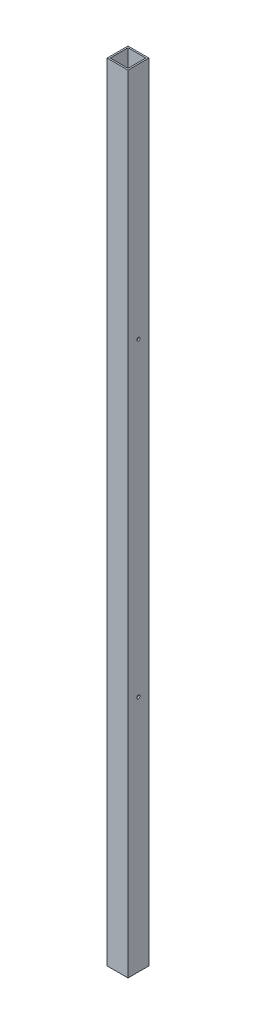
ISO-10303-21;
HEADER;
FILE_DESCRIPTION(('STEP AP214'),'2;1');
FILE_NAME('part.step','',(''),(''),'','','');
FILE_SCHEMA(('AUTOMOTIVE_DESIGN { 1 0 10303 214 1 1 1 1 }'));
ENDSEC;
DATA;
#1=APPLICATION_CONTEXT('core data for automotive mechanical design processes');
#2=APPLICATION_PROTOCOL_DEFINITION('international standard','automotive_design',2000,#1);
#3=PRODUCT_CONTEXT('',#1,'mechanical');
#4=PRODUCT('Part','Part','',(#3));
#5=PRODUCT_RELATED_PRODUCT_CATEGORY('part','',(#4));
#6=PRODUCT_DEFINITION_FORMATION('','',#4);
#7=PRODUCT_DEFINITION_CONTEXT('part definition',#1,'design');
#8=PRODUCT_DEFINITION('design','',#6,#7);
#9=PRODUCT_DEFINITION_SHAPE('','',#8);
#10=(LENGTH_UNIT() NAMED_UNIT(*) SI_UNIT(.MILLI.,.METRE.));
#11=(NAMED_UNIT(*) PLANE_ANGLE_UNIT() SI_UNIT($,.RADIAN.));
#12=(NAMED_UNIT(*) SI_UNIT($,.STERADIAN.) SOLID_ANGLE_UNIT());
#13=UNCERTAINTY_MEASURE_WITH_UNIT(LENGTH_MEASURE(1.E-05),#10,'distance_accuracy_value','');
#14=(GEOMETRIC_REPRESENTATION_CONTEXT(3) GLOBAL_UNCERTAINTY_ASSIGNED_CONTEXT((#13)) GLOBAL_UNIT_ASSIGNED_CONTEXT((#10,
#11,#12)) REPRESENTATION_CONTEXT('',''));
#15=CARTESIAN_POINT('',(0.,0.,0.));
#16=DIRECTION('',(0.,0.,1.));
#17=DIRECTION('',(1.,0.,0.));
#18=AXIS2_PLACEMENT_3D('',#15,#16,#17);
#19=CARTESIAN_POINT('',(1881.79309813872,-330.2,22.225));
#20=DIRECTION('',(1.,0.,0.));
#21=DIRECTION('',(0.,1.,0.));
#22=AXIS2_PLACEMENT_3D('',#19,#20,#21);
#23=CYLINDRICAL_SURFACE('',#22,3.3782);
#24=CARTESIAN_POINT('',(244.475,-330.2,22.225));
#25=DIRECTION('',(1.,0.,0.));
#26=DIRECTION('',(0.,1.,0.));
#27=AXIS2_PLACEMENT_3D('',#24,#25,#26);
#28=CIRCLE('',#27,3.3782);
#29=CARTESIAN_POINT('',(244.475,-326.8218,22.225));
#30=VERTEX_POINT('',#29);
#31=EDGE_CURVE('E19',#30,#30,#28,.F.);
#32=ORIENTED_EDGE('',*,*,#31,.T.);
#33=EDGE_LOOP('',(#32));
#34=FACE_BOUND('',#33,.T.);
#35=CARTESIAN_POINT('',(247.65,-330.2,22.225));
#36=DIRECTION('',(1.,0.,0.));
#37=DIRECTION('',(0.,1.,0.));
#38=AXIS2_PLACEMENT_3D('',#35,#36,#37);
#39=CIRCLE('',#38,3.3782);
#40=CARTESIAN_POINT('',(247.65,-326.8218,22.225));
#41=VERTEX_POINT('',#40);
#42=EDGE_CURVE('E132',#41,#41,#39,.F.);
#43=ORIENTED_EDGE('',*,*,#42,.F.);
#44=EDGE_LOOP('',(#43));
#45=FACE_BOUND('',#44,.T.);
#46=ADVANCED_FACE('F16',(#34,#45),#23,.F.);
#47=CARTESIAN_POINT('',(1881.79309813872,330.2,22.225));
#48=DIRECTION('',(1.,0.,0.));
#49=DIRECTION('',(0.,1.,0.));
#50=AXIS2_PLACEMENT_3D('',#47,#48,#49);
#51=CYLINDRICAL_SURFACE('',#50,3.3782);
#52=CARTESIAN_POINT('',(244.475,330.2,22.225));
#53=DIRECTION('',(1.,0.,0.));
#54=DIRECTION('',(0.,1.,0.));
#55=AXIS2_PLACEMENT_3D('',#52,#53,#54);
#56=CIRCLE('',#55,3.3782);
#57=CARTESIAN_POINT('',(244.475,333.5782,22.225));
#58=VERTEX_POINT('',#57);
#59=EDGE_CURVE('E142',#58,#58,#56,.F.);
#60=ORIENTED_EDGE('',*,*,#59,.T.);
#61=EDGE_LOOP('',(#60));
#62=FACE_BOUND('',#61,.T.);
#63=CARTESIAN_POINT('',(247.65,330.2,22.225));
#64=DIRECTION('',(1.,0.,0.));
#65=DIRECTION('',(0.,1.,0.));
#66=AXIS2_PLACEMENT_3D('',#63,#64,#65);
#67=CIRCLE('',#66,3.3782);
#68=CARTESIAN_POINT('',(247.65,333.5782,22.225));
#69=VERTEX_POINT('',#68);
#70=EDGE_CURVE('E130',#69,#69,#67,.F.);
#71=ORIENTED_EDGE('',*,*,#70,.F.);
#72=EDGE_LOOP('',(#71));
#73=FACE_BOUND('',#72,.T.);
#74=ADVANCED_FACE('F292',(#62,#73),#51,.F.);
#75=CARTESIAN_POINT('',(1881.79309813872,-330.2,22.225));
#76=DIRECTION('',(1.,0.,0.));
#77=DIRECTION('',(0.,1.,0.));
#78=AXIS2_PLACEMENT_3D('',#75,#76,#77);
#79=CYLINDRICAL_SURFACE('',#78,3.3782);
#80=CARTESIAN_POINT('',(203.2,-330.2,22.225));
#81=DIRECTION('',(1.,0.,0.));
#82=DIRECTION('',(0.,1.,0.));
#83=AXIS2_PLACEMENT_3D('',#80,#81,#82);
#84=CIRCLE('',#83,3.3782);
#85=CARTESIAN_POINT('',(203.2,-326.8218,22.225));
#86=VERTEX_POINT('',#85);
#87=EDGE_CURVE('E148',#86,#86,#84,.F.);
#88=ORIENTED_EDGE('',*,*,#87,.T.);
#89=EDGE_LOOP('',(#88));
#90=FACE_BOUND('',#89,.T.);
#91=CARTESIAN_POINT('',(206.375,-330.2,22.225));
#92=DIRECTION('',(1.,0.,0.));
#93=DIRECTION('',(0.,1.,0.));
#94=AXIS2_PLACEMENT_3D('',#91,#92,#93);
#95=CIRCLE('',#94,3.3782);
#96=CARTESIAN_POINT('',(206.375,-326.8218,22.225));
#97=VERTEX_POINT('',#96);
#98=EDGE_CURVE('E141',#97,#97,#95,.F.);
#99=ORIENTED_EDGE('',*,*,#98,.F.);
#100=EDGE_LOOP('',(#99));
#101=FACE_BOUND('',#100,.T.);
#102=ADVANCED_FACE('F283',(#90,#101),#79,.F.);
#103=CARTESIAN_POINT('',(1881.79309813872,330.2,22.225));
#104=DIRECTION('',(1.,0.,0.));
#105=DIRECTION('',(0.,1.,0.));
#106=AXIS2_PLACEMENT_3D('',#103,#104,#105);
#107=CYLINDRICAL_SURFACE('',#106,3.3782);
#108=CARTESIAN_POINT('',(203.2,330.2,22.225));
#109=DIRECTION('',(1.,0.,0.));
#110=DIRECTION('',(0.,1.,0.));
#111=AXIS2_PLACEMENT_3D('',#108,#109,#110);
#112=CIRCLE('',#111,3.3782);
#113=CARTESIAN_POINT('',(203.2,333.5782,22.225));
#114=VERTEX_POINT('',#113);
#115=EDGE_CURVE('E143',#114,#114,#112,.F.);
#116=ORIENTED_EDGE('',*,*,#115,.T.);
#117=EDGE_LOOP('',(#116));
#118=FACE_BOUND('',#117,.T.);
#119=CARTESIAN_POINT('',(206.375,330.2,22.225));
#120=DIRECTION('',(1.,0.,0.));
#121=DIRECTION('',(0.,1.,0.));
#122=AXIS2_PLACEMENT_3D('',#119,#120,#121);
#123=CIRCLE('',#122,3.3782);
#124=CARTESIAN_POINT('',(206.375,333.5782,22.225));
#125=VERTEX_POINT('',#124);
#126=EDGE_CURVE('E136',#125,#125,#123,.F.);
#127=ORIENTED_EDGE('',*,*,#126,.F.);
#128=EDGE_LOOP('',(#127));
#129=FACE_BOUND('',#128,.T.);
#130=ADVANCED_FACE('F187',(#118,#129),#107,.F.);
#131=CARTESIAN_POINT('',(-104.775,-2.55795384873636E-13,0.));
#132=DIRECTION('',(0.,0.,1.));
#133=DIRECTION('',(1.,0.,0.));
#134=AXIS2_PLACEMENT_3D('',#131,#132,#133);
#135=PLANE('',#134);
#136=DIRECTION('',(1.,0.,0.));
#137=VECTOR('',#136,1.);
#138=CARTESIAN_POINT('',(225.425,-838.2,0.));
#139=LINE('',#138,#137);
#140=CARTESIAN_POINT('',(203.2,-838.2,0.));
#141=VERTEX_POINT('',#140);
#142=CARTESIAN_POINT('',(247.65,-838.2,0.));
#143=VERTEX_POINT('',#142);
#144=EDGE_CURVE('E339',#141,#143,#139,.T.);
#145=ORIENTED_EDGE('',*,*,#144,.F.);
#146=DIRECTION('',(0.,1.,0.));
#147=VECTOR('',#146,1.);
#148=CARTESIAN_POINT('',(203.2,-2.55795384873636E-13,0.));
#149=LINE('',#148,#147);
#150=CARTESIAN_POINT('',(203.2,838.2,0.));
#151=VERTEX_POINT('',#150);
#152=EDGE_CURVE('E364',#141,#151,#149,.T.);
#153=ORIENTED_EDGE('',*,*,#152,.T.);
#154=DIRECTION('',(1.,0.,0.));
#155=VECTOR('',#154,1.);
#156=CARTESIAN_POINT('',(225.425,838.2,0.));
#157=LINE('',#156,#155);
#158=CARTESIAN_POINT('',(247.65,838.2,0.));
#159=VERTEX_POINT('',#158);
#160=EDGE_CURVE('E101',#151,#159,#157,.T.);
#161=ORIENTED_EDGE('',*,*,#160,.T.);
#162=DIRECTION('',(0.,1.,0.));
#163=VECTOR('',#162,1.);
#164=CARTESIAN_POINT('',(247.65,-2.55795384873636E-13,0.));
#165=LINE('',#164,#163);
#166=EDGE_CURVE('E126',#143,#159,#165,.T.);
#167=ORIENTED_EDGE('',*,*,#166,.F.);
#168=EDGE_LOOP('',(#145,#153,#161,#167));
#169=FACE_BOUND('',#168,.T.);
#170=ADVANCED_FACE('F177',(#169),#135,.F.);
#171=CARTESIAN_POINT('',(244.475,-2.56636462922595E-13,44.45));
#172=DIRECTION('',(1.,0.,0.));
#173=DIRECTION('',(0.,1.,0.));
#174=AXIS2_PLACEMENT_3D('',#171,#172,#173);
#175=PLANE('',#174);
#176=DIRECTION('',(0.,0.,-1.));
#177=VECTOR('',#176,1.);
#178=CARTESIAN_POINT('',(244.475,-838.2,44.45));
#179=LINE('',#178,#177);
#180=CARTESIAN_POINT('',(244.475,-838.2,41.275));
#181=VERTEX_POINT('',#180);
#182=CARTESIAN_POINT('',(244.475,-838.2,3.175));
#183=VERTEX_POINT('',#182);
#184=EDGE_CURVE('E356',#181,#183,#179,.T.);
#185=ORIENTED_EDGE('',*,*,#184,.F.);
#186=DIRECTION('',(0.,1.,0.));
#187=VECTOR('',#186,1.);
#188=CARTESIAN_POINT('',(244.475,-2.55795384873636E-13,41.275));
#189=LINE('',#188,#187);
#190=CARTESIAN_POINT('',(244.475,838.2,41.275));
#191=VERTEX_POINT('',#190);
#192=EDGE_CURVE('E112',#181,#191,#189,.T.);
#193=ORIENTED_EDGE('',*,*,#192,.T.);
#194=DIRECTION('',(0.,0.,-1.));
#195=VECTOR('',#194,1.);
#196=CARTESIAN_POINT('',(244.475,838.2,44.45));
#197=LINE('',#196,#195);
#198=CARTESIAN_POINT('',(244.475,838.2,3.175));
#199=VERTEX_POINT('',#198);
#200=EDGE_CURVE('E116',#191,#199,#197,.T.);
#201=ORIENTED_EDGE('',*,*,#200,.T.);
#202=DIRECTION('',(0.,1.,0.));
#203=VECTOR('',#202,1.);
#204=CARTESIAN_POINT('',(244.475,-2.55795384873636E-13,3.175));
#205=LINE('',#204,#203);
#206=EDGE_CURVE('E137',#183,#199,#205,.T.);
#207=ORIENTED_EDGE('',*,*,#206,.F.);
#208=EDGE_LOOP('',(#185,#193,#201,#207));
#209=FACE_BOUND('',#208,.T.);
#210=ORIENTED_EDGE('',*,*,#59,.F.);
#211=EDGE_LOOP('',(#210));
#212=FACE_BOUND('',#211,.T.);
#213=ORIENTED_EDGE('',*,*,#31,.F.);
#214=EDGE_LOOP('',(#213));
#215=FACE_BOUND('',#214,.T.);
#216=ADVANCED_FACE('F174',(#209,#212,#215),#175,.F.);
#217=CARTESIAN_POINT('',(-104.775,-2.55795384873636E-13,3.175));
#218=DIRECTION('',(0.,0.,1.));
#219=DIRECTION('',(1.,0.,0.));
#220=AXIS2_PLACEMENT_3D('',#217,#218,#219);
#221=PLANE('',#220);
#222=DIRECTION('',(0.,1.,0.));
#223=VECTOR('',#222,1.);
#224=CARTESIAN_POINT('',(206.375,-2.54954306824678E-13,3.175));
#225=LINE('',#224,#223);
#226=CARTESIAN_POINT('',(206.375,-838.2,3.175));
#227=VERTEX_POINT('',#226);
#228=CARTESIAN_POINT('',(206.375,838.2,3.175));
#229=VERTEX_POINT('',#228);
#230=EDGE_CURVE('E95',#227,#229,#225,.T.);
#231=ORIENTED_EDGE('',*,*,#230,.F.);
#232=DIRECTION('',(1.,0.,0.));
#233=VECTOR('',#232,1.);
#234=CARTESIAN_POINT('',(225.425,-838.2,3.175));
#235=LINE('',#234,#233);
#236=EDGE_CURVE('E352',#183,#227,#235,.F.);
#237=ORIENTED_EDGE('',*,*,#236,.F.);
#238=ORIENTED_EDGE('',*,*,#206,.T.);
#239=DIRECTION('',(1.,0.,0.));
#240=VECTOR('',#239,1.);
#241=CARTESIAN_POINT('',(225.425,838.2,3.175));
#242=LINE('',#241,#240);
#243=EDGE_CURVE('E118',#199,#229,#242,.F.);
#244=ORIENTED_EDGE('',*,*,#243,.T.);
#245=EDGE_LOOP('',(#231,#237,#238,#244));
#246=FACE_BOUND('',#245,.T.);
#247=ADVANCED_FACE('F176',(#246),#221,.T.);
#248=CARTESIAN_POINT('',(206.375,-2.54954306824678E-13,44.45));
#249=DIRECTION('',(1.,0.,0.));
#250=DIRECTION('',(0.,1.,0.));
#251=AXIS2_PLACEMENT_3D('',#248,#249,#250);
#252=PLANE('',#251);
#253=DIRECTION('',(0.,1.,0.));
#254=VECTOR('',#253,1.);
#255=CARTESIAN_POINT('',(206.375,-2.55795384873636E-13,41.275));
#256=LINE('',#255,#254);
#257=CARTESIAN_POINT('',(206.375,838.2,41.275));
#258=VERTEX_POINT('',#257);
#259=CARTESIAN_POINT('',(206.375,-838.2,41.275));
#260=VERTEX_POINT('',#259);
#261=EDGE_CURVE('E93',#258,#260,#256,.F.);
#262=ORIENTED_EDGE('',*,*,#261,.T.);
#263=DIRECTION('',(0.,0.,-1.));
#264=VECTOR('',#263,1.);
#265=CARTESIAN_POINT('',(206.375,-838.2,44.45));
#266=LINE('',#265,#264);
#267=EDGE_CURVE('E349',#227,#260,#266,.F.);
#268=ORIENTED_EDGE('',*,*,#267,.F.);
#269=ORIENTED_EDGE('',*,*,#230,.T.);
#270=DIRECTION('',(0.,0.,-1.));
#271=VECTOR('',#270,1.);
#272=CARTESIAN_POINT('',(206.375,838.2,44.45));
#273=LINE('',#272,#271);
#274=EDGE_CURVE('E88',#229,#258,#273,.F.);
#275=ORIENTED_EDGE('',*,*,#274,.T.);
#276=EDGE_LOOP('',(#262,#268,#269,#275));
#277=FACE_BOUND('',#276,.T.);
#278=ORIENTED_EDGE('',*,*,#126,.T.);
#279=EDGE_LOOP('',(#278));
#280=FACE_BOUND('',#279,.T.);
#281=ORIENTED_EDGE('',*,*,#98,.T.);
#282=EDGE_LOOP('',(#281));
#283=FACE_BOUND('',#282,.T.);
#284=ADVANCED_FACE('F90',(#277,#280,#283),#252,.T.);
#285=CARTESIAN_POINT('',(-104.775,-2.55795384873636E-13,41.275));
#286=DIRECTION('',(0.,0.,1.));
#287=DIRECTION('',(1.,0.,0.));
#288=AXIS2_PLACEMENT_3D('',#285,#286,#287);
#289=PLANE('',#288);
#290=DIRECTION('',(1.,0.,0.));
#291=VECTOR('',#290,1.);
#292=CARTESIAN_POINT('',(225.425,-838.2,41.275));
#293=LINE('',#292,#291);
#294=EDGE_CURVE('E109',#260,#181,#293,.T.);
#295=ORIENTED_EDGE('',*,*,#294,.F.);
#296=ORIENTED_EDGE('',*,*,#261,.F.);
#297=DIRECTION('',(1.,0.,0.));
#298=VECTOR('',#297,1.);
#299=CARTESIAN_POINT('',(225.425,838.2,41.275));
#300=LINE('',#299,#298);
#301=EDGE_CURVE('E100',#258,#191,#300,.T.);
#302=ORIENTED_EDGE('',*,*,#301,.T.);
#303=ORIENTED_EDGE('',*,*,#192,.F.);
#304=EDGE_LOOP('',(#295,#296,#302,#303));
#305=FACE_BOUND('',#304,.T.);
#306=ADVANCED_FACE('F105',(#305),#289,.F.);
#307=CARTESIAN_POINT('',(247.65,-2.55795384873636E-13,44.45));
#308=DIRECTION('',(1.,0.,0.));
#309=DIRECTION('',(0.,1.,0.));
#310=AXIS2_PLACEMENT_3D('',#307,#308,#309);
#311=PLANE('',#310);
#312=DIRECTION('',(0.,1.,0.));
#313=VECTOR('',#312,1.);
#314=CARTESIAN_POINT('',(247.65,-2.55795384873636E-13,44.45));
#315=LINE('',#314,#313);
#316=CARTESIAN_POINT('',(247.65,-838.2,44.45));
#317=VERTEX_POINT('',#316);
#318=CARTESIAN_POINT('',(247.65,838.2,44.45));
#319=VERTEX_POINT('',#318);
#320=EDGE_CURVE('E328',#317,#319,#315,.T.);
#321=ORIENTED_EDGE('',*,*,#320,.F.);
#322=DIRECTION('',(0.,0.,-1.));
#323=VECTOR('',#322,1.);
#324=CARTESIAN_POINT('',(247.65,-838.2,44.45));
#325=LINE('',#324,#323);
#326=EDGE_CURVE('E330',#143,#317,#325,.F.);
#327=ORIENTED_EDGE('',*,*,#326,.F.);
#328=ORIENTED_EDGE('',*,*,#166,.T.);
#329=DIRECTION('',(0.,0.,-1.));
#330=VECTOR('',#329,1.);
#331=CARTESIAN_POINT('',(247.65,838.2,44.45));
#332=LINE('',#331,#330);
#333=EDGE_CURVE('E124',#159,#319,#332,.F.);
#334=ORIENTED_EDGE('',*,*,#333,.T.);
#335=EDGE_LOOP('',(#321,#327,#328,#334));
#336=FACE_BOUND('',#335,.T.);
#337=ORIENTED_EDGE('',*,*,#70,.T.);
#338=EDGE_LOOP('',(#337));
#339=FACE_BOUND('',#338,.T.);
#340=ORIENTED_EDGE('',*,*,#42,.T.);
#341=EDGE_LOOP('',(#340));
#342=FACE_BOUND('',#341,.T.);
#343=ADVANCED_FACE('F208',(#336,#339,#342),#311,.T.);
#344=CARTESIAN_POINT('',(225.425,838.2,44.45));
#345=DIRECTION('',(0.,-1.,0.));
#346=DIRECTION('',(0.,0.,-1.));
#347=AXIS2_PLACEMENT_3D('',#344,#345,#346);
#348=PLANE('',#347);
#349=ORIENTED_EDGE('',*,*,#200,.F.);
#350=ORIENTED_EDGE('',*,*,#301,.F.);
#351=ORIENTED_EDGE('',*,*,#274,.F.);
#352=ORIENTED_EDGE('',*,*,#243,.F.);
#353=EDGE_LOOP('',(#349,#350,#351,#352));
#354=FACE_BOUND('',#353,.T.);
#355=DIRECTION('',(0.,0.,1.));
#356=VECTOR('',#355,1.);
#357=CARTESIAN_POINT('',(203.2,838.2,44.45));
#358=LINE('',#357,#356);
#359=CARTESIAN_POINT('',(203.2,838.2,44.45));
#360=VERTEX_POINT('',#359);
#361=EDGE_CURVE('E147',#151,#360,#358,.T.);
#362=ORIENTED_EDGE('',*,*,#361,.T.);
#363=DIRECTION('',(1.,0.,0.));
#364=VECTOR('',#363,1.);
#365=CARTESIAN_POINT('',(-104.775,838.2,44.45));
#366=LINE('',#365,#364);
#367=EDGE_CURVE('E336',#319,#360,#366,.F.);
#368=ORIENTED_EDGE('',*,*,#367,.F.);
#369=ORIENTED_EDGE('',*,*,#333,.F.);
#370=ORIENTED_EDGE('',*,*,#160,.F.);
#371=EDGE_LOOP('',(#362,#368,#369,#370));
#372=FACE_BOUND('',#371,.T.);
#373=ADVANCED_FACE('F114',(#354,#372),#348,.F.);
#374=CARTESIAN_POINT('',(203.2,-2.55795384873636E-13,44.45));
#375=DIRECTION('',(1.,0.,0.));
#376=DIRECTION('',(0.,1.,0.));
#377=AXIS2_PLACEMENT_3D('',#374,#375,#376);
#378=PLANE('',#377);
#379=DIRECTION('',(0.,0.,-1.));
#380=VECTOR('',#379,1.);
#381=CARTESIAN_POINT('',(203.2,-838.2,44.45));
#382=LINE('',#381,#380);
#383=CARTESIAN_POINT('',(203.2,-838.2,44.45));
#384=VERTEX_POINT('',#383);
#385=EDGE_CURVE('E39',#384,#141,#382,.T.);
#386=ORIENTED_EDGE('',*,*,#385,.F.);
#387=DIRECTION('',(0.,1.,0.));
#388=VECTOR('',#387,1.);
#389=CARTESIAN_POINT('',(203.2,-2.55795384873636E-13,44.45));
#390=LINE('',#389,#388);
#391=EDGE_CURVE('E26',#360,#384,#390,.F.);
#392=ORIENTED_EDGE('',*,*,#391,.F.);
#393=ORIENTED_EDGE('',*,*,#361,.F.);
#394=ORIENTED_EDGE('',*,*,#152,.F.);
#395=EDGE_LOOP('',(#386,#392,#393,#394));
#396=FACE_BOUND('',#395,.T.);
#397=ORIENTED_EDGE('',*,*,#115,.F.);
#398=EDGE_LOOP('',(#397));
#399=FACE_BOUND('',#398,.T.);
#400=ORIENTED_EDGE('',*,*,#87,.F.);
#401=EDGE_LOOP('',(#400));
#402=FACE_BOUND('',#401,.T.);
#403=ADVANCED_FACE('F199',(#396,#399,#402),#378,.F.);
#404=CARTESIAN_POINT('',(225.425,-838.2,44.45));
#405=DIRECTION('',(0.,-1.,0.));
#406=DIRECTION('',(0.,0.,-1.));
#407=AXIS2_PLACEMENT_3D('',#404,#405,#406);
#408=PLANE('',#407);
#409=ORIENTED_EDGE('',*,*,#267,.T.);
#410=ORIENTED_EDGE('',*,*,#294,.T.);
#411=ORIENTED_EDGE('',*,*,#184,.T.);
#412=ORIENTED_EDGE('',*,*,#236,.T.);
#413=EDGE_LOOP('',(#409,#410,#411,#412));
#414=FACE_BOUND('',#413,.T.);
#415=DIRECTION('',(1.,0.,0.));
#416=VECTOR('',#415,1.);
#417=CARTESIAN_POINT('',(-104.775,-838.2,44.45));
#418=LINE('',#417,#416);
#419=EDGE_CURVE('E11',#384,#317,#418,.T.);
#420=ORIENTED_EDGE('',*,*,#419,.F.);
#421=ORIENTED_EDGE('',*,*,#385,.T.);
#422=ORIENTED_EDGE('',*,*,#144,.T.);
#423=ORIENTED_EDGE('',*,*,#326,.T.);
#424=EDGE_LOOP('',(#420,#421,#422,#423));
#425=FACE_BOUND('',#424,.T.);
#426=ADVANCED_FACE('F193',(#414,#425),#408,.T.);
#427=CARTESIAN_POINT('',(-104.775,-2.55795384873636E-13,44.45));
#428=DIRECTION('',(0.,0.,1.));
#429=DIRECTION('',(1.,0.,0.));
#430=AXIS2_PLACEMENT_3D('',#427,#428,#429);
#431=PLANE('',#430);
#432=ORIENTED_EDGE('',*,*,#391,.T.);
#433=ORIENTED_EDGE('',*,*,#419,.T.);
#434=ORIENTED_EDGE('',*,*,#320,.T.);
#435=ORIENTED_EDGE('',*,*,#367,.T.);
#436=EDGE_LOOP('',(#432,#433,#434,#435));
#437=FACE_BOUND('',#436,.T.);
#438=ADVANCED_FACE('F191',(#437),#431,.T.);
#439=CLOSED_SHELL('',(#46,#74,#102,#130,#170,#216,#247,#284,#306,#343,#373,#403,#426,#438));
#440=MANIFOLD_SOLID_BREP('B1',#439);
#441=ADVANCED_BREP_SHAPE_REPRESENTATION('',(#18,#440),#14);
#442=SHAPE_DEFINITION_REPRESENTATION(#9,#441);
ENDSEC;
END-ISO-10303-21;
